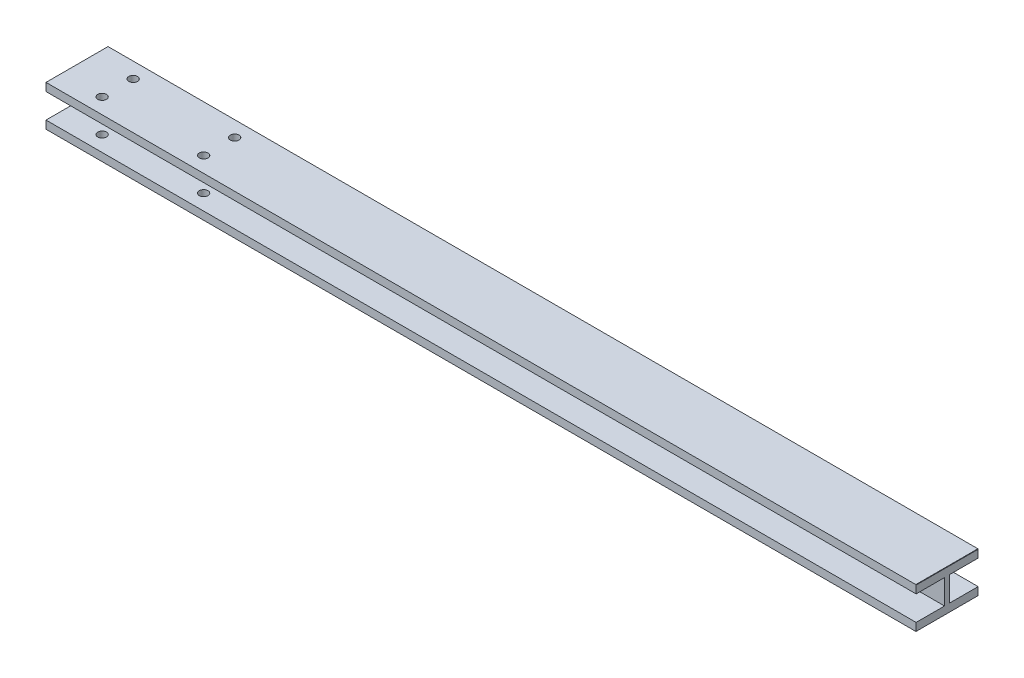
ISO-10303-21;
HEADER;
FILE_DESCRIPTION(('STEP AP214'),'2;1');
FILE_NAME('part.step','',(''),(''),'','','');
FILE_SCHEMA(('AUTOMOTIVE_DESIGN { 1 0 10303 214 1 1 1 1 }'));
ENDSEC;
DATA;
#1=APPLICATION_CONTEXT('core data for automotive mechanical design processes');
#2=APPLICATION_PROTOCOL_DEFINITION('international standard','automotive_design',2000,#1);
#3=PRODUCT_CONTEXT('',#1,'mechanical');
#4=PRODUCT('Part','Part','',(#3));
#5=PRODUCT_RELATED_PRODUCT_CATEGORY('part','',(#4));
#6=PRODUCT_DEFINITION_FORMATION('','',#4);
#7=PRODUCT_DEFINITION_CONTEXT('part definition',#1,'design');
#8=PRODUCT_DEFINITION('design','',#6,#7);
#9=PRODUCT_DEFINITION_SHAPE('','',#8);
#10=(LENGTH_UNIT() NAMED_UNIT(*) SI_UNIT(.MILLI.,.METRE.));
#11=(NAMED_UNIT(*) PLANE_ANGLE_UNIT() SI_UNIT($,.RADIAN.));
#12=(NAMED_UNIT(*) SI_UNIT($,.STERADIAN.) SOLID_ANGLE_UNIT());
#13=UNCERTAINTY_MEASURE_WITH_UNIT(LENGTH_MEASURE(1.E-05),#10,'distance_accuracy_value','');
#14=(GEOMETRIC_REPRESENTATION_CONTEXT(3) GLOBAL_UNCERTAINTY_ASSIGNED_CONTEXT((#13)) GLOBAL_UNIT_ASSIGNED_CONTEXT((#10,
#11,#12)) REPRESENTATION_CONTEXT('',''));
#15=CARTESIAN_POINT('',(0.,0.,0.));
#16=DIRECTION('',(0.,0.,1.));
#17=DIRECTION('',(1.,0.,0.));
#18=AXIS2_PLACEMENT_3D('',#15,#16,#17);
#19=CARTESIAN_POINT('',(3000.,140.,0.));
#20=DIRECTION('',(-1.,0.,0.));
#21=DIRECTION('',(0.,0.,1.));
#22=AXIS2_PLACEMENT_3D('',#19,#20,#21);
#23=PLANE('',#22);
#24=DIRECTION('',(0.,-1.,0.));
#25=VECTOR('',#24,1.);
#26=CARTESIAN_POINT('',(3000.,140.,213.9));
#27=LINE('',#26,#25);
#28=CARTESIAN_POINT('',(3000.,27.5,213.9));
#29=VERTEX_POINT('',#28);
#30=CARTESIAN_POINT('',(3000.,0.5,213.9));
#31=VERTEX_POINT('',#30);
#32=EDGE_CURVE('E230',#29,#31,#27,.T.);
#33=ORIENTED_EDGE('',*,*,#32,.T.);
#34=DIRECTION('',(0.,0.,1.));
#35=VECTOR('',#34,1.);
#36=CARTESIAN_POINT('',(3000.,0.5,213.9));
#37=LINE('',#36,#35);
#38=CARTESIAN_POINT('',(3000.,0.5,0.5));
#39=VERTEX_POINT('',#38);
#40=EDGE_CURVE('E212',#39,#31,#37,.T.);
#41=ORIENTED_EDGE('',*,*,#40,.F.);
#42=DIRECTION('',(0.,-1.,0.));
#43=VECTOR('',#42,1.);
#44=CARTESIAN_POINT('',(3000.,139.,0.5));
#45=LINE('',#44,#43);
#46=CARTESIAN_POINT('',(3000.,27.5,0.5));
#47=VERTEX_POINT('',#46);
#48=EDGE_CURVE('E543',#47,#39,#45,.T.);
#49=ORIENTED_EDGE('',*,*,#48,.F.);
#50=DIRECTION('',(0.,0.,-1.));
#51=VECTOR('',#50,1.);
#52=CARTESIAN_POINT('',(3000.,27.5,0.));
#53=LINE('',#52,#51);
#54=CARTESIAN_POINT('',(3000.,27.5,97.9999999999999));
#55=VERTEX_POINT('',#54);
#56=EDGE_CURVE('E515',#55,#47,#53,.T.);
#57=ORIENTED_EDGE('',*,*,#56,.F.);
#58=DIRECTION('',(0.,-1.,0.));
#59=VECTOR('',#58,1.);
#60=CARTESIAN_POINT('',(3000.,0.,97.9999999999999));
#61=LINE('',#60,#59);
#62=CARTESIAN_POINT('',(3000.,112.5,97.9999999999999));
#63=VERTEX_POINT('',#62);
#64=EDGE_CURVE('E511',#63,#55,#61,.T.);
#65=ORIENTED_EDGE('',*,*,#64,.F.);
#66=DIRECTION('',(0.,0.,1.));
#67=VECTOR('',#66,1.);
#68=CARTESIAN_POINT('',(3000.,112.5,0.));
#69=LINE('',#68,#67);
#70=CARTESIAN_POINT('',(3000.,112.5,0.5));
#71=VERTEX_POINT('',#70);
#72=EDGE_CURVE('E503',#71,#63,#69,.T.);
#73=ORIENTED_EDGE('',*,*,#72,.F.);
#74=CARTESIAN_POINT('',(3000.,139.,0.5));
#75=VERTEX_POINT('',#74);
#76=EDGE_CURVE('E545',#75,#71,#45,.T.);
#77=ORIENTED_EDGE('',*,*,#76,.F.);
#78=DIRECTION('',(0.,0.,-1.));
#79=VECTOR('',#78,1.);
#80=CARTESIAN_POINT('',(3000.,139.,0.));
#81=LINE('',#80,#79);
#82=CARTESIAN_POINT('',(3000.,139.,213.9));
#83=VERTEX_POINT('',#82);
#84=EDGE_CURVE('E582',#83,#75,#81,.T.);
#85=ORIENTED_EDGE('',*,*,#84,.F.);
#86=CARTESIAN_POINT('',(3000.,112.5,213.9));
#87=VERTEX_POINT('',#86);
#88=EDGE_CURVE('E239',#83,#87,#27,.T.);
#89=ORIENTED_EDGE('',*,*,#88,.T.);
#90=DIRECTION('',(0.,0.,-1.));
#91=VECTOR('',#90,1.);
#92=CARTESIAN_POINT('',(3000.,112.5,0.));
#93=LINE('',#92,#91);
#94=CARTESIAN_POINT('',(3000.,112.5,115.9));
#95=VERTEX_POINT('',#94);
#96=EDGE_CURVE('E471',#87,#95,#93,.T.);
#97=ORIENTED_EDGE('',*,*,#96,.T.);
#98=DIRECTION('',(0.,-1.,0.));
#99=VECTOR('',#98,1.);
#100=CARTESIAN_POINT('',(3000.,0.,115.9));
#101=LINE('',#100,#99);
#102=CARTESIAN_POINT('',(3000.,27.5,115.9));
#103=VERTEX_POINT('',#102);
#104=EDGE_CURVE('E480',#95,#103,#101,.T.);
#105=ORIENTED_EDGE('',*,*,#104,.T.);
#106=DIRECTION('',(0.,0.,1.));
#107=VECTOR('',#106,1.);
#108=CARTESIAN_POINT('',(3000.,27.5,0.));
#109=LINE('',#108,#107);
#110=EDGE_CURVE('E237',#103,#29,#109,.T.);
#111=ORIENTED_EDGE('',*,*,#110,.T.);
#112=EDGE_LOOP('',(#33,#41,#49,#57,#65,#73,#77,#85,#89,#97,#105,#111));
#113=FACE_BOUND('',#112,.T.);
#114=ADVANCED_FACE('F51',(#113),#23,.F.);
#115=CARTESIAN_POINT('',(0.,140.,0.));
#116=DIRECTION('',(1.,0.,0.));
#117=DIRECTION('',(0.,0.,-1.));
#118=AXIS2_PLACEMENT_3D('',#115,#116,#117);
#119=PLANE('',#118);
#120=DIRECTION('',(0.,0.,1.));
#121=VECTOR('',#120,1.);
#122=CARTESIAN_POINT('',(0.,27.5,0.));
#123=LINE('',#122,#121);
#124=CARTESIAN_POINT('',(0.,27.5,115.9));
#125=VERTEX_POINT('',#124);
#126=CARTESIAN_POINT('',(0.,27.5,213.9));
#127=VERTEX_POINT('',#126);
#128=EDGE_CURVE('E479',#125,#127,#123,.T.);
#129=ORIENTED_EDGE('',*,*,#128,.F.);
#130=DIRECTION('',(0.,-1.,0.));
#131=VECTOR('',#130,1.);
#132=CARTESIAN_POINT('',(0.,0.,115.9));
#133=LINE('',#132,#131);
#134=CARTESIAN_POINT('',(0.,112.5,115.9));
#135=VERTEX_POINT('',#134);
#136=EDGE_CURVE('E606',#135,#125,#133,.T.);
#137=ORIENTED_EDGE('',*,*,#136,.F.);
#138=DIRECTION('',(0.,0.,-1.));
#139=VECTOR('',#138,1.);
#140=CARTESIAN_POINT('',(0.,112.5,0.));
#141=LINE('',#140,#139);
#142=CARTESIAN_POINT('',(0.,112.5,213.9));
#143=VERTEX_POINT('',#142);
#144=EDGE_CURVE('E499',#143,#135,#141,.T.);
#145=ORIENTED_EDGE('',*,*,#144,.F.);
#146=DIRECTION('',(0.,-1.,0.));
#147=VECTOR('',#146,1.);
#148=CARTESIAN_POINT('',(0.,140.,213.9));
#149=LINE('',#148,#147);
#150=CARTESIAN_POINT('',(0.,140.,213.9));
#151=VERTEX_POINT('',#150);
#152=EDGE_CURVE('E251',#151,#143,#149,.T.);
#153=ORIENTED_EDGE('',*,*,#152,.F.);
#154=DIRECTION('',(0.,0.,1.));
#155=VECTOR('',#154,1.);
#156=CARTESIAN_POINT('',(0.,140.,0.));
#157=LINE('',#156,#155);
#158=CARTESIAN_POINT('',(0.,140.,0.));
#159=VERTEX_POINT('',#158);
#160=EDGE_CURVE('E356',#159,#151,#157,.T.);
#161=ORIENTED_EDGE('',*,*,#160,.F.);
#162=DIRECTION('',(0.,-1.,0.));
#163=VECTOR('',#162,1.);
#164=CARTESIAN_POINT('',(0.,140.,0.));
#165=LINE('',#164,#163);
#166=CARTESIAN_POINT('',(0.,112.5,0.));
#167=VERTEX_POINT('',#166);
#168=EDGE_CURVE('E240',#159,#167,#165,.T.);
#169=ORIENTED_EDGE('',*,*,#168,.T.);
#170=DIRECTION('',(0.,0.,1.));
#171=VECTOR('',#170,1.);
#172=CARTESIAN_POINT('',(0.,112.5,0.));
#173=LINE('',#172,#171);
#174=CARTESIAN_POINT('',(0.,112.5,97.9999999999999));
#175=VERTEX_POINT('',#174);
#176=EDGE_CURVE('E506',#167,#175,#173,.T.);
#177=ORIENTED_EDGE('',*,*,#176,.T.);
#178=DIRECTION('',(0.,-1.,0.));
#179=VECTOR('',#178,1.);
#180=CARTESIAN_POINT('',(0.,0.,97.9999999999999));
#181=LINE('',#180,#179);
#182=CARTESIAN_POINT('',(0.,27.5,97.9999999999999));
#183=VERTEX_POINT('',#182);
#184=EDGE_CURVE('E500',#175,#183,#181,.T.);
#185=ORIENTED_EDGE('',*,*,#184,.T.);
#186=DIRECTION('',(0.,0.,-1.));
#187=VECTOR('',#186,1.);
#188=CARTESIAN_POINT('',(0.,27.5,0.));
#189=LINE('',#188,#187);
#190=CARTESIAN_POINT('',(0.,27.5,0.));
#191=VERTEX_POINT('',#190);
#192=EDGE_CURVE('E393',#183,#191,#189,.T.);
#193=ORIENTED_EDGE('',*,*,#192,.T.);
#194=CARTESIAN_POINT('',(0.,0.,0.));
#195=VERTEX_POINT('',#194);
#196=EDGE_CURVE('E247',#191,#195,#165,.T.);
#197=ORIENTED_EDGE('',*,*,#196,.T.);
#198=DIRECTION('',(0.,0.,1.));
#199=VECTOR('',#198,1.);
#200=CARTESIAN_POINT('',(0.,0.,0.));
#201=LINE('',#200,#199);
#202=CARTESIAN_POINT('',(0.,0.,213.9));
#203=VERTEX_POINT('',#202);
#204=EDGE_CURVE('E351',#195,#203,#201,.T.);
#205=ORIENTED_EDGE('',*,*,#204,.T.);
#206=EDGE_CURVE('E245',#127,#203,#149,.T.);
#207=ORIENTED_EDGE('',*,*,#206,.F.);
#208=EDGE_LOOP('',(#129,#137,#145,#153,#161,#169,#177,#185,#193,#197,#205,#207));
#209=FACE_BOUND('',#208,.T.);
#210=ADVANCED_FACE('F53',(#209),#119,.F.);
#211=CARTESIAN_POINT('',(0.,140.,213.9));
#212=DIRECTION('',(0.,0.,-1.));
#213=DIRECTION('',(-1.,0.,0.));
#214=AXIS2_PLACEMENT_3D('',#211,#212,#213);
#215=PLANE('',#214);
#216=DIRECTION('',(1.,0.,0.));
#217=VECTOR('',#216,1.);
#218=CARTESIAN_POINT('',(0.,0.,213.9));
#219=LINE('',#218,#217);
#220=CARTESIAN_POINT('',(2999.,0.,213.9));
#221=VERTEX_POINT('',#220);
#222=EDGE_CURVE('E371',#203,#221,#219,.T.);
#223=ORIENTED_EDGE('',*,*,#222,.T.);
#224=DIRECTION('',(0.,-1.,0.));
#225=VECTOR('',#224,1.);
#226=CARTESIAN_POINT('',(2999.,0.5,213.9));
#227=LINE('',#226,#225);
#228=CARTESIAN_POINT('',(2999.,0.5,213.9));
#229=VERTEX_POINT('',#228);
#230=EDGE_CURVE('E231',#229,#221,#227,.T.);
#231=ORIENTED_EDGE('',*,*,#230,.F.);
#232=DIRECTION('',(-1.,0.,0.));
#233=VECTOR('',#232,1.);
#234=CARTESIAN_POINT('',(3000.,0.5,213.9));
#235=LINE('',#234,#233);
#236=EDGE_CURVE('E216',#31,#229,#235,.T.);
#237=ORIENTED_EDGE('',*,*,#236,.F.);
#238=ORIENTED_EDGE('',*,*,#32,.F.);
#239=DIRECTION('',(1.,0.,0.));
#240=VECTOR('',#239,1.);
#241=CARTESIAN_POINT('',(0.,27.5,213.9));
#242=LINE('',#241,#240);
#243=EDGE_CURVE('E260',#127,#29,#242,.T.);
#244=ORIENTED_EDGE('',*,*,#243,.F.);
#245=ORIENTED_EDGE('',*,*,#206,.T.);
#246=EDGE_LOOP('',(#223,#231,#237,#238,#244,#245));
#247=FACE_BOUND('',#246,.T.);
#248=ADVANCED_FACE('F228',(#247),#215,.F.);
#249=DIRECTION('',(1.,0.,0.));
#250=VECTOR('',#249,1.);
#251=CARTESIAN_POINT('',(3000.,139.,213.9));
#252=LINE('',#251,#250);
#253=CARTESIAN_POINT('',(2999.,139.,213.9));
#254=VERTEX_POINT('',#253);
#255=EDGE_CURVE('E593',#254,#83,#252,.T.);
#256=ORIENTED_EDGE('',*,*,#255,.F.);
#257=DIRECTION('',(0.,1.,0.));
#258=VECTOR('',#257,1.);
#259=CARTESIAN_POINT('',(2999.,139.,213.9));
#260=LINE('',#259,#258);
#261=CARTESIAN_POINT('',(2999.,140.,213.9));
#262=VERTEX_POINT('',#261);
#263=EDGE_CURVE('E516',#254,#262,#260,.T.);
#264=ORIENTED_EDGE('',*,*,#263,.T.);
#265=DIRECTION('',(1.,0.,0.));
#266=VECTOR('',#265,1.);
#267=CARTESIAN_POINT('',(0.,140.,213.9));
#268=LINE('',#267,#266);
#269=EDGE_CURVE('E360',#151,#262,#268,.T.);
#270=ORIENTED_EDGE('',*,*,#269,.F.);
#271=ORIENTED_EDGE('',*,*,#152,.T.);
#272=DIRECTION('',(1.,0.,0.));
#273=VECTOR('',#272,1.);
#274=CARTESIAN_POINT('',(0.,112.5,213.9));
#275=LINE('',#274,#273);
#276=EDGE_CURVE('E473',#143,#87,#275,.T.);
#277=ORIENTED_EDGE('',*,*,#276,.T.);
#278=ORIENTED_EDGE('',*,*,#88,.F.);
#279=EDGE_LOOP('',(#256,#264,#270,#271,#277,#278));
#280=FACE_BOUND('',#279,.T.);
#281=ADVANCED_FACE('F485',(#280),#215,.F.);
#282=CARTESIAN_POINT('',(0.,140.,0.));
#283=DIRECTION('',(0.,0.,1.));
#284=DIRECTION('',(1.,0.,0.));
#285=AXIS2_PLACEMENT_3D('',#282,#283,#284);
#286=PLANE('',#285);
#287=DIRECTION('',(-1.,0.,0.));
#288=VECTOR('',#287,1.);
#289=CARTESIAN_POINT('',(3000.,139.,0.));
#290=LINE('',#289,#288);
#291=CARTESIAN_POINT('',(2999.5,139.,0.));
#292=VERTEX_POINT('',#291);
#293=CARTESIAN_POINT('',(2999.,139.,0.));
#294=VERTEX_POINT('',#293);
#295=EDGE_CURVE('E586',#292,#294,#290,.T.);
#296=ORIENTED_EDGE('',*,*,#295,.F.);
#297=DIRECTION('',(0.,1.,0.));
#298=VECTOR('',#297,1.);
#299=CARTESIAN_POINT('',(2999.5,139.,0.));
#300=LINE('',#299,#298);
#301=CARTESIAN_POINT('',(2999.5,112.5,0.));
#302=VERTEX_POINT('',#301);
#303=EDGE_CURVE('E552',#302,#292,#300,.T.);
#304=ORIENTED_EDGE('',*,*,#303,.F.);
#305=DIRECTION('',(1.,0.,0.));
#306=VECTOR('',#305,1.);
#307=CARTESIAN_POINT('',(0.,112.5,0.));
#308=LINE('',#307,#306);
#309=EDGE_CURVE('E526',#167,#302,#308,.T.);
#310=ORIENTED_EDGE('',*,*,#309,.F.);
#311=ORIENTED_EDGE('',*,*,#168,.F.);
#312=DIRECTION('',(-1.,0.,0.));
#313=VECTOR('',#312,1.);
#314=CARTESIAN_POINT('',(0.,140.,0.));
#315=LINE('',#314,#313);
#316=CARTESIAN_POINT('',(2999.,140.,0.));
#317=VERTEX_POINT('',#316);
#318=EDGE_CURVE('E365',#317,#159,#315,.T.);
#319=ORIENTED_EDGE('',*,*,#318,.F.);
#320=DIRECTION('',(0.,1.,0.));
#321=VECTOR('',#320,1.);
#322=CARTESIAN_POINT('',(2999.,139.,0.));
#323=LINE('',#322,#321);
#324=EDGE_CURVE('E596',#294,#317,#323,.T.);
#325=ORIENTED_EDGE('',*,*,#324,.F.);
#326=EDGE_LOOP('',(#296,#304,#310,#311,#319,#325));
#327=FACE_BOUND('',#326,.T.);
#328=ADVANCED_FACE('F627',(#327),#286,.F.);
#329=CARTESIAN_POINT('',(140.,140.,53.4749999999998));
#330=DIRECTION('',(0.,-1.,0.));
#331=DIRECTION('',(0.,0.,-1.));
#332=AXIS2_PLACEMENT_3D('',#329,#330,#331);
#333=CYLINDRICAL_SURFACE('',#332,15.);
#334=CARTESIAN_POINT('',(140.,112.5,53.4749999999998));
#335=DIRECTION('',(0.,1.,0.));
#336=DIRECTION('',(0.,0.,1.));
#337=AXIS2_PLACEMENT_3D('',#334,#335,#336);
#338=CIRCLE('',#337,15.);
#339=CARTESIAN_POINT('',(140.,112.5,68.4749999999998));
#340=VERTEX_POINT('',#339);
#341=EDGE_CURVE('E287',#340,#340,#338,.T.);
#342=ORIENTED_EDGE('',*,*,#341,.F.);
#343=EDGE_LOOP('',(#342));
#344=FACE_BOUND('',#343,.T.);
#345=CARTESIAN_POINT('',(140.,140.,53.4749999999998));
#346=DIRECTION('',(0.,1.,0.));
#347=DIRECTION('',(0.,0.,1.));
#348=AXIS2_PLACEMENT_3D('',#345,#346,#347);
#349=CIRCLE('',#348,15.);
#350=CARTESIAN_POINT('',(140.,140.,68.4749999999998));
#351=VERTEX_POINT('',#350);
#352=EDGE_CURVE('E348',#351,#351,#349,.T.);
#353=ORIENTED_EDGE('',*,*,#352,.T.);
#354=EDGE_LOOP('',(#353));
#355=FACE_BOUND('',#354,.T.);
#356=ADVANCED_FACE('F696',(#344,#355),#333,.F.);
#357=CARTESIAN_POINT('',(140.,140.,160.425));
#358=DIRECTION('',(0.,-1.,0.));
#359=DIRECTION('',(0.,0.,-1.));
#360=AXIS2_PLACEMENT_3D('',#357,#358,#359);
#361=CYLINDRICAL_SURFACE('',#360,15.);
#362=CARTESIAN_POINT('',(140.,0.,160.425));
#363=DIRECTION('',(0.,1.,0.));
#364=DIRECTION('',(0.,0.,-1.));
#365=AXIS2_PLACEMENT_3D('',#362,#363,#364);
#366=CIRCLE('',#365,15.);
#367=CARTESIAN_POINT('',(140.,0.,145.425));
#368=VERTEX_POINT('',#367);
#369=EDGE_CURVE('E343',#368,#368,#366,.T.);
#370=ORIENTED_EDGE('',*,*,#369,.F.);
#371=EDGE_LOOP('',(#370));
#372=FACE_BOUND('',#371,.T.);
#373=CARTESIAN_POINT('',(140.,27.5,160.425));
#374=DIRECTION('',(0.,1.,0.));
#375=DIRECTION('',(0.,0.,1.));
#376=AXIS2_PLACEMENT_3D('',#373,#374,#375);
#377=CIRCLE('',#376,15.);
#378=CARTESIAN_POINT('',(140.,27.5,175.425));
#379=VERTEX_POINT('',#378);
#380=EDGE_CURVE('E266',#379,#379,#377,.T.);
#381=ORIENTED_EDGE('',*,*,#380,.T.);
#382=EDGE_LOOP('',(#381));
#383=FACE_BOUND('',#382,.T.);
#384=ADVANCED_FACE('F702',(#372,#383),#361,.F.);
#385=CARTESIAN_POINT('',(140.,140.,160.425));
#386=DIRECTION('',(0.,1.,0.));
#387=DIRECTION('',(0.,0.,-1.));
#388=AXIS2_PLACEMENT_3D('',#385,#386,#387);
#389=CIRCLE('',#388,15.);
#390=CARTESIAN_POINT('',(140.,140.,145.425));
#391=VERTEX_POINT('',#390);
#392=EDGE_CURVE('E339',#391,#391,#389,.T.);
#393=ORIENTED_EDGE('',*,*,#392,.T.);
#394=EDGE_LOOP('',(#393));
#395=FACE_BOUND('',#394,.T.);
#396=CARTESIAN_POINT('',(140.,112.5,160.425));
#397=DIRECTION('',(0.,-1.,0.));
#398=DIRECTION('',(0.,0.,-1.));
#399=AXIS2_PLACEMENT_3D('',#396,#397,#398);
#400=CIRCLE('',#399,15.);
#401=CARTESIAN_POINT('',(140.,112.5,145.425));
#402=VERTEX_POINT('',#401);
#403=EDGE_CURVE('E259',#402,#402,#400,.T.);
#404=ORIENTED_EDGE('',*,*,#403,.T.);
#405=EDGE_LOOP('',(#404));
#406=FACE_BOUND('',#405,.T.);
#407=ADVANCED_FACE('F419',(#395,#406),#361,.F.);
#408=CARTESIAN_POINT('',(490.,140.,53.4749999999997));
#409=DIRECTION('',(0.,-1.,0.));
#410=DIRECTION('',(0.,0.,-1.));
#411=AXIS2_PLACEMENT_3D('',#408,#409,#410);
#412=CYLINDRICAL_SURFACE('',#411,15.);
#413=CARTESIAN_POINT('',(490.,112.5,53.4749999999997));
#414=DIRECTION('',(0.,1.,0.));
#415=DIRECTION('',(0.,0.,1.));
#416=AXIS2_PLACEMENT_3D('',#413,#414,#415);
#417=CIRCLE('',#416,15.);
#418=CARTESIAN_POINT('',(490.,112.5,68.4749999999997));
#419=VERTEX_POINT('',#418);
#420=EDGE_CURVE('E286',#419,#419,#417,.T.);
#421=ORIENTED_EDGE('',*,*,#420,.F.);
#422=EDGE_LOOP('',(#421));
#423=FACE_BOUND('',#422,.T.);
#424=CARTESIAN_POINT('',(490.,140.,53.4749999999997));
#425=DIRECTION('',(0.,1.,0.));
#426=DIRECTION('',(0.,0.,1.));
#427=AXIS2_PLACEMENT_3D('',#424,#425,#426);
#428=CIRCLE('',#427,15.);
#429=CARTESIAN_POINT('',(490.,140.,68.4749999999997));
#430=VERTEX_POINT('',#429);
#431=EDGE_CURVE('E330',#430,#430,#428,.T.);
#432=ORIENTED_EDGE('',*,*,#431,.T.);
#433=EDGE_LOOP('',(#432));
#434=FACE_BOUND('',#433,.T.);
#435=ADVANCED_FACE('F415',(#423,#434),#412,.F.);
#436=CARTESIAN_POINT('',(490.,140.,160.425));
#437=DIRECTION('',(0.,-1.,0.));
#438=DIRECTION('',(0.,0.,-1.));
#439=AXIS2_PLACEMENT_3D('',#436,#437,#438);
#440=CYLINDRICAL_SURFACE('',#439,15.);
#441=CARTESIAN_POINT('',(490.,0.,160.425));
#442=DIRECTION('',(0.,1.,0.));
#443=DIRECTION('',(0.,0.,-1.));
#444=AXIS2_PLACEMENT_3D('',#441,#442,#443);
#445=CIRCLE('',#444,15.);
#446=CARTESIAN_POINT('',(490.,0.,145.425));
#447=VERTEX_POINT('',#446);
#448=EDGE_CURVE('E317',#447,#447,#445,.T.);
#449=ORIENTED_EDGE('',*,*,#448,.F.);
#450=EDGE_LOOP('',(#449));
#451=FACE_BOUND('',#450,.T.);
#452=CARTESIAN_POINT('',(490.,27.5,160.425));
#453=DIRECTION('',(0.,1.,0.));
#454=DIRECTION('',(0.,0.,1.));
#455=AXIS2_PLACEMENT_3D('',#452,#453,#454);
#456=CIRCLE('',#455,15.);
#457=CARTESIAN_POINT('',(490.,27.5,175.425));
#458=VERTEX_POINT('',#457);
#459=EDGE_CURVE('E261',#458,#458,#456,.T.);
#460=ORIENTED_EDGE('',*,*,#459,.T.);
#461=EDGE_LOOP('',(#460));
#462=FACE_BOUND('',#461,.T.);
#463=ADVANCED_FACE('F418',(#451,#462),#440,.F.);
#464=CARTESIAN_POINT('',(490.,140.,160.425));
#465=DIRECTION('',(0.,1.,0.));
#466=DIRECTION('',(0.,0.,-1.));
#467=AXIS2_PLACEMENT_3D('',#464,#465,#466);
#468=CIRCLE('',#467,15.);
#469=CARTESIAN_POINT('',(490.,140.,145.425));
#470=VERTEX_POINT('',#469);
#471=EDGE_CURVE('E321',#470,#470,#468,.T.);
#472=ORIENTED_EDGE('',*,*,#471,.T.);
#473=EDGE_LOOP('',(#472));
#474=FACE_BOUND('',#473,.T.);
#475=CARTESIAN_POINT('',(490.,112.5,160.425));
#476=DIRECTION('',(0.,-1.,0.));
#477=DIRECTION('',(0.,0.,-1.));
#478=AXIS2_PLACEMENT_3D('',#475,#476,#477);
#479=CIRCLE('',#478,15.);
#480=CARTESIAN_POINT('',(490.,112.5,145.425));
#481=VERTEX_POINT('',#480);
#482=EDGE_CURVE('E255',#481,#481,#479,.T.);
#483=ORIENTED_EDGE('',*,*,#482,.T.);
#484=EDGE_LOOP('',(#483));
#485=FACE_BOUND('',#484,.T.);
#486=ADVANCED_FACE('F448',(#474,#485),#440,.F.);
#487=CARTESIAN_POINT('',(0.,140.,0.));
#488=DIRECTION('',(0.,1.,0.));
#489=DIRECTION('',(0.,0.,1.));
#490=AXIS2_PLACEMENT_3D('',#487,#488,#489);
#491=PLANE('',#490);
#492=DIRECTION('',(0.,0.,1.));
#493=VECTOR('',#492,1.);
#494=CARTESIAN_POINT('',(2999.,140.,0.));
#495=LINE('',#494,#493);
#496=EDGE_CURVE('E581',#317,#262,#495,.T.);
#497=ORIENTED_EDGE('',*,*,#496,.F.);
#498=ORIENTED_EDGE('',*,*,#318,.T.);
#499=ORIENTED_EDGE('',*,*,#160,.T.);
#500=ORIENTED_EDGE('',*,*,#269,.T.);
#501=EDGE_LOOP('',(#497,#498,#499,#500));
#502=FACE_BOUND('',#501,.T.);
#503=ORIENTED_EDGE('',*,*,#431,.F.);
#504=EDGE_LOOP('',(#503));
#505=FACE_BOUND('',#504,.T.);
#506=ORIENTED_EDGE('',*,*,#352,.F.);
#507=EDGE_LOOP('',(#506));
#508=FACE_BOUND('',#507,.T.);
#509=ORIENTED_EDGE('',*,*,#392,.F.);
#510=EDGE_LOOP('',(#509));
#511=FACE_BOUND('',#510,.T.);
#512=ORIENTED_EDGE('',*,*,#471,.F.);
#513=EDGE_LOOP('',(#512));
#514=FACE_BOUND('',#513,.T.);
#515=ADVANCED_FACE('F445',(#502,#505,#508,#511,#514),#491,.T.);
#516=CARTESIAN_POINT('',(0.,0.,0.));
#517=DIRECTION('',(0.,1.,0.));
#518=DIRECTION('',(0.,0.,1.));
#519=AXIS2_PLACEMENT_3D('',#516,#517,#518);
#520=PLANE('',#519);
#521=DIRECTION('',(-1.,0.,0.));
#522=VECTOR('',#521,1.);
#523=CARTESIAN_POINT('',(0.,0.,0.));
#524=LINE('',#523,#522);
#525=CARTESIAN_POINT('',(2999.,0.,0.));
#526=VERTEX_POINT('',#525);
#527=EDGE_CURVE('E361',#526,#195,#524,.T.);
#528=ORIENTED_EDGE('',*,*,#527,.F.);
#529=DIRECTION('',(0.,0.,-1.));
#530=VECTOR('',#529,1.);
#531=CARTESIAN_POINT('',(2999.,0.,213.9));
#532=LINE('',#531,#530);
#533=CARTESIAN_POINT('',(2999.,0.,103.95));
#534=VERTEX_POINT('',#533);
#535=EDGE_CURVE('E938',#534,#526,#532,.T.);
#536=ORIENTED_EDGE('',*,*,#535,.F.);
#537=DIRECTION('',(1.,0.,0.));
#538=VECTOR('',#537,1.);
#539=CARTESIAN_POINT('',(3000.,0.,103.95));
#540=LINE('',#539,#538);
#541=CARTESIAN_POINT('',(2997.,0.,103.95));
#542=VERTEX_POINT('',#541);
#543=EDGE_CURVE('E296',#542,#534,#540,.T.);
#544=ORIENTED_EDGE('',*,*,#543,.F.);
#545=DIRECTION('',(0.,0.,-1.));
#546=VECTOR('',#545,1.);
#547=CARTESIAN_POINT('',(2997.,0.,109.95));
#548=LINE('',#547,#546);
#549=CARTESIAN_POINT('',(2997.,0.,109.95));
#550=VERTEX_POINT('',#549);
#551=EDGE_CURVE('E307',#550,#542,#548,.T.);
#552=ORIENTED_EDGE('',*,*,#551,.F.);
#553=DIRECTION('',(-1.,0.,0.));
#554=VECTOR('',#553,1.);
#555=CARTESIAN_POINT('',(3000.,0.,109.95));
#556=LINE('',#555,#554);
#557=CARTESIAN_POINT('',(2999.,0.,109.95));
#558=VERTEX_POINT('',#557);
#559=EDGE_CURVE('E291',#558,#550,#556,.T.);
#560=ORIENTED_EDGE('',*,*,#559,.F.);
#561=EDGE_CURVE('E223',#221,#558,#532,.T.);
#562=ORIENTED_EDGE('',*,*,#561,.F.);
#563=ORIENTED_EDGE('',*,*,#222,.F.);
#564=ORIENTED_EDGE('',*,*,#204,.F.);
#565=EDGE_LOOP('',(#528,#536,#544,#552,#560,#562,#563,#564));
#566=FACE_BOUND('',#565,.T.);
#567=CARTESIAN_POINT('',(140.,0.,53.4749999999998));
#568=DIRECTION('',(0.,1.,0.));
#569=DIRECTION('',(0.,0.,1.));
#570=AXIS2_PLACEMENT_3D('',#567,#568,#569);
#571=CIRCLE('',#570,15.);
#572=CARTESIAN_POINT('',(140.,0.,68.4749999999998));
#573=VERTEX_POINT('',#572);
#574=EDGE_CURVE('E342',#573,#573,#571,.T.);
#575=ORIENTED_EDGE('',*,*,#574,.T.);
#576=EDGE_LOOP('',(#575));
#577=FACE_BOUND('',#576,.T.);
#578=ORIENTED_EDGE('',*,*,#369,.T.);
#579=EDGE_LOOP('',(#578));
#580=FACE_BOUND('',#579,.T.);
#581=CARTESIAN_POINT('',(490.,0.,53.4749999999997));
#582=DIRECTION('',(0.,1.,0.));
#583=DIRECTION('',(0.,0.,1.));
#584=AXIS2_PLACEMENT_3D('',#581,#582,#583);
#585=CIRCLE('',#584,15.);
#586=CARTESIAN_POINT('',(490.,0.,68.4749999999997));
#587=VERTEX_POINT('',#586);
#588=EDGE_CURVE('E325',#587,#587,#585,.T.);
#589=ORIENTED_EDGE('',*,*,#588,.T.);
#590=EDGE_LOOP('',(#589));
#591=FACE_BOUND('',#590,.T.);
#592=ORIENTED_EDGE('',*,*,#448,.T.);
#593=EDGE_LOOP('',(#592));
#594=FACE_BOUND('',#593,.T.);
#595=ADVANCED_FACE('F396',(#566,#577,#580,#591,#594),#520,.F.);
#596=DIRECTION('',(1.,0.,0.));
#597=VECTOR('',#596,1.);
#598=CARTESIAN_POINT('',(3000.,0.5,0.));
#599=LINE('',#598,#597);
#600=CARTESIAN_POINT('',(2999.,0.5,0.));
#601=VERTEX_POINT('',#600);
#602=CARTESIAN_POINT('',(2999.5,0.5,0.));
#603=VERTEX_POINT('',#602);
#604=EDGE_CURVE('E947',#601,#603,#599,.T.);
#605=ORIENTED_EDGE('',*,*,#604,.F.);
#606=DIRECTION('',(0.,-1.,0.));
#607=VECTOR('',#606,1.);
#608=CARTESIAN_POINT('',(2999.,0.5,0.));
#609=LINE('',#608,#607);
#610=EDGE_CURVE('E383',#601,#526,#609,.T.);
#611=ORIENTED_EDGE('',*,*,#610,.T.);
#612=ORIENTED_EDGE('',*,*,#527,.T.);
#613=ORIENTED_EDGE('',*,*,#196,.F.);
#614=DIRECTION('',(1.,0.,0.));
#615=VECTOR('',#614,1.);
#616=CARTESIAN_POINT('',(0.,27.5,0.));
#617=LINE('',#616,#615);
#618=CARTESIAN_POINT('',(2999.5,27.5,0.));
#619=VERTEX_POINT('',#618);
#620=EDGE_CURVE('E530',#191,#619,#617,.T.);
#621=ORIENTED_EDGE('',*,*,#620,.T.);
#622=EDGE_CURVE('E546',#603,#619,#300,.T.);
#623=ORIENTED_EDGE('',*,*,#622,.F.);
#624=EDGE_LOOP('',(#605,#611,#612,#613,#621,#623));
#625=FACE_BOUND('',#624,.T.);
#626=ADVANCED_FACE('F381',(#625),#286,.F.);
#627=CARTESIAN_POINT('',(140.,27.5,53.4749999999998));
#628=DIRECTION('',(0.,-1.,0.));
#629=DIRECTION('',(0.,0.,-1.));
#630=AXIS2_PLACEMENT_3D('',#627,#628,#629);
#631=CIRCLE('',#630,15.);
#632=CARTESIAN_POINT('',(140.,27.5,38.4749999999998));
#633=VERTEX_POINT('',#632);
#634=EDGE_CURVE('E281',#633,#633,#631,.T.);
#635=ORIENTED_EDGE('',*,*,#634,.F.);
#636=EDGE_LOOP('',(#635));
#637=FACE_BOUND('',#636,.T.);
#638=ORIENTED_EDGE('',*,*,#574,.F.);
#639=EDGE_LOOP('',(#638));
#640=FACE_BOUND('',#639,.T.);
#641=ADVANCED_FACE('F705',(#637,#640),#333,.F.);
#642=CARTESIAN_POINT('',(490.,27.5,53.4749999999997));
#643=DIRECTION('',(0.,-1.,0.));
#644=DIRECTION('',(0.,0.,-1.));
#645=AXIS2_PLACEMENT_3D('',#642,#643,#644);
#646=CIRCLE('',#645,15.);
#647=CARTESIAN_POINT('',(490.,27.5,38.4749999999997));
#648=VERTEX_POINT('',#647);
#649=EDGE_CURVE('E267',#648,#648,#646,.T.);
#650=ORIENTED_EDGE('',*,*,#649,.F.);
#651=EDGE_LOOP('',(#650));
#652=FACE_BOUND('',#651,.T.);
#653=ORIENTED_EDGE('',*,*,#588,.F.);
#654=EDGE_LOOP('',(#653));
#655=FACE_BOUND('',#654,.T.);
#656=ADVANCED_FACE('F421',(#652,#655),#412,.F.);
#657=CARTESIAN_POINT('',(3000.,0.1,103.95));
#658=DIRECTION('',(0.,0.,-1.));
#659=DIRECTION('',(-1.,0.,0.));
#660=AXIS2_PLACEMENT_3D('',#657,#658,#659);
#661=PLANE('',#660);
#662=ORIENTED_EDGE('',*,*,#543,.T.);
#663=DIRECTION('',(0.,1.,0.));
#664=VECTOR('',#663,1.);
#665=CARTESIAN_POINT('',(2999.,0.1,103.95));
#666=LINE('',#665,#664);
#667=CARTESIAN_POINT('',(2999.,0.1,103.95));
#668=VERTEX_POINT('',#667);
#669=EDGE_CURVE('E556',#534,#668,#666,.T.);
#670=ORIENTED_EDGE('',*,*,#669,.T.);
#671=DIRECTION('',(1.,0.,0.));
#672=VECTOR('',#671,1.);
#673=CARTESIAN_POINT('',(3000.,0.1,103.95));
#674=LINE('',#673,#672);
#675=CARTESIAN_POINT('',(2997.,0.1,103.95));
#676=VERTEX_POINT('',#675);
#677=EDGE_CURVE('E300',#676,#668,#674,.T.);
#678=ORIENTED_EDGE('',*,*,#677,.F.);
#679=DIRECTION('',(0.,-1.,0.));
#680=VECTOR('',#679,1.);
#681=CARTESIAN_POINT('',(2997.,0.1,103.95));
#682=LINE('',#681,#680);
#683=EDGE_CURVE('E314',#676,#542,#682,.T.);
#684=ORIENTED_EDGE('',*,*,#683,.T.);
#685=EDGE_LOOP('',(#662,#670,#678,#684));
#686=FACE_BOUND('',#685,.T.);
#687=ADVANCED_FACE('F718',(#686),#661,.F.);
#688=CARTESIAN_POINT('',(2997.,0.1,109.95));
#689=DIRECTION('',(-1.,0.,0.));
#690=DIRECTION('',(0.,0.,1.));
#691=AXIS2_PLACEMENT_3D('',#688,#689,#690);
#692=PLANE('',#691);
#693=ORIENTED_EDGE('',*,*,#551,.T.);
#694=ORIENTED_EDGE('',*,*,#683,.F.);
#695=DIRECTION('',(0.,0.,-1.));
#696=VECTOR('',#695,1.);
#697=CARTESIAN_POINT('',(2997.,0.1,109.95));
#698=LINE('',#697,#696);
#699=CARTESIAN_POINT('',(2997.,0.1,109.95));
#700=VERTEX_POINT('',#699);
#701=EDGE_CURVE('E295',#700,#676,#698,.T.);
#702=ORIENTED_EDGE('',*,*,#701,.F.);
#703=DIRECTION('',(0.,-1.,0.));
#704=VECTOR('',#703,1.);
#705=CARTESIAN_POINT('',(2997.,0.1,109.95));
#706=LINE('',#705,#704);
#707=EDGE_CURVE('E304',#700,#550,#706,.T.);
#708=ORIENTED_EDGE('',*,*,#707,.T.);
#709=EDGE_LOOP('',(#693,#694,#702,#708));
#710=FACE_BOUND('',#709,.T.);
#711=ADVANCED_FACE('F727',(#710),#692,.F.);
#712=CARTESIAN_POINT('',(3000.,0.1,109.95));
#713=DIRECTION('',(0.,0.,1.));
#714=DIRECTION('',(1.,0.,0.));
#715=AXIS2_PLACEMENT_3D('',#712,#713,#714);
#716=PLANE('',#715);
#717=DIRECTION('',(-1.,0.,0.));
#718=VECTOR('',#717,1.);
#719=CARTESIAN_POINT('',(3000.,0.1,109.95));
#720=LINE('',#719,#718);
#721=CARTESIAN_POINT('',(2999.,0.1,109.95));
#722=VERTEX_POINT('',#721);
#723=EDGE_CURVE('E292',#722,#700,#720,.T.);
#724=ORIENTED_EDGE('',*,*,#723,.F.);
#725=DIRECTION('',(0.,-1.,0.));
#726=VECTOR('',#725,1.);
#727=CARTESIAN_POINT('',(2999.,0.1,109.95));
#728=LINE('',#727,#726);
#729=EDGE_CURVE('E954',#722,#558,#728,.T.);
#730=ORIENTED_EDGE('',*,*,#729,.T.);
#731=ORIENTED_EDGE('',*,*,#559,.T.);
#732=ORIENTED_EDGE('',*,*,#707,.F.);
#733=EDGE_LOOP('',(#724,#730,#731,#732));
#734=FACE_BOUND('',#733,.T.);
#735=ADVANCED_FACE('F723',(#734),#716,.F.);
#736=CARTESIAN_POINT('',(0.,0.1,0.));
#737=DIRECTION('',(0.,1.,0.));
#738=DIRECTION('',(0.,0.,1.));
#739=AXIS2_PLACEMENT_3D('',#736,#737,#738);
#740=PLANE('',#739);
#741=ORIENTED_EDGE('',*,*,#677,.T.);
#742=DIRECTION('',(0.,0.,1.));
#743=VECTOR('',#742,1.);
#744=CARTESIAN_POINT('',(2999.,0.1,0.));
#745=LINE('',#744,#743);
#746=EDGE_CURVE('E12',#668,#722,#745,.T.);
#747=ORIENTED_EDGE('',*,*,#746,.T.);
#748=ORIENTED_EDGE('',*,*,#723,.T.);
#749=ORIENTED_EDGE('',*,*,#701,.T.);
#750=EDGE_LOOP('',(#741,#747,#748,#749));
#751=FACE_BOUND('',#750,.T.);
#752=ADVANCED_FACE('F726',(#751),#740,.F.);
#753=CARTESIAN_POINT('',(0.,27.5,0.));
#754=DIRECTION('',(0.,1.,0.));
#755=DIRECTION('',(0.,0.,1.));
#756=AXIS2_PLACEMENT_3D('',#753,#754,#755);
#757=PLANE('',#756);
#758=ORIENTED_EDGE('',*,*,#380,.F.);
#759=EDGE_LOOP('',(#758));
#760=FACE_BOUND('',#759,.T.);
#761=ORIENTED_EDGE('',*,*,#459,.F.);
#762=EDGE_LOOP('',(#761));
#763=FACE_BOUND('',#762,.T.);
#764=ORIENTED_EDGE('',*,*,#110,.F.);
#765=DIRECTION('',(1.,0.,0.));
#766=VECTOR('',#765,1.);
#767=CARTESIAN_POINT('',(0.,27.5,115.9));
#768=LINE('',#767,#766);
#769=EDGE_CURVE('E493',#125,#103,#768,.T.);
#770=ORIENTED_EDGE('',*,*,#769,.F.);
#771=ORIENTED_EDGE('',*,*,#128,.T.);
#772=ORIENTED_EDGE('',*,*,#243,.T.);
#773=EDGE_LOOP('',(#764,#770,#771,#772));
#774=FACE_BOUND('',#773,.T.);
#775=ADVANCED_FACE('F466',(#760,#763,#774),#757,.T.);
#776=CARTESIAN_POINT('',(0.,112.5,0.));
#777=DIRECTION('',(0.,-1.,0.));
#778=DIRECTION('',(0.,0.,-1.));
#779=AXIS2_PLACEMENT_3D('',#776,#777,#778);
#780=PLANE('',#779);
#781=ORIENTED_EDGE('',*,*,#403,.F.);
#782=EDGE_LOOP('',(#781));
#783=FACE_BOUND('',#782,.T.);
#784=ORIENTED_EDGE('',*,*,#482,.F.);
#785=EDGE_LOOP('',(#784));
#786=FACE_BOUND('',#785,.T.);
#787=ORIENTED_EDGE('',*,*,#96,.F.);
#788=ORIENTED_EDGE('',*,*,#276,.F.);
#789=ORIENTED_EDGE('',*,*,#144,.T.);
#790=DIRECTION('',(1.,0.,0.));
#791=VECTOR('',#790,1.);
#792=CARTESIAN_POINT('',(0.,112.5,115.9));
#793=LINE('',#792,#791);
#794=EDGE_CURVE('E476',#135,#95,#793,.T.);
#795=ORIENTED_EDGE('',*,*,#794,.T.);
#796=EDGE_LOOP('',(#787,#788,#789,#795));
#797=FACE_BOUND('',#796,.T.);
#798=ADVANCED_FACE('F462',(#783,#786,#797),#780,.T.);
#799=CARTESIAN_POINT('',(0.,0.,115.9));
#800=DIRECTION('',(0.,0.,1.));
#801=DIRECTION('',(1.,0.,0.));
#802=AXIS2_PLACEMENT_3D('',#799,#800,#801);
#803=PLANE('',#802);
#804=ORIENTED_EDGE('',*,*,#104,.F.);
#805=ORIENTED_EDGE('',*,*,#794,.F.);
#806=ORIENTED_EDGE('',*,*,#136,.T.);
#807=ORIENTED_EDGE('',*,*,#769,.T.);
#808=EDGE_LOOP('',(#804,#805,#806,#807));
#809=FACE_BOUND('',#808,.T.);
#810=ADVANCED_FACE('F465',(#809),#803,.T.);
#811=CARTESIAN_POINT('',(0.,0.,97.9999999999999));
#812=DIRECTION('',(0.,0.,1.));
#813=DIRECTION('',(0.,-1.,0.));
#814=AXIS2_PLACEMENT_3D('',#811,#812,#813);
#815=PLANE('',#814);
#816=ORIENTED_EDGE('',*,*,#64,.T.);
#817=DIRECTION('',(1.,0.,0.));
#818=VECTOR('',#817,1.);
#819=CARTESIAN_POINT('',(0.,27.5,97.9999999999999));
#820=LINE('',#819,#818);
#821=EDGE_CURVE('E510',#183,#55,#820,.T.);
#822=ORIENTED_EDGE('',*,*,#821,.F.);
#823=ORIENTED_EDGE('',*,*,#184,.F.);
#824=DIRECTION('',(1.,0.,0.));
#825=VECTOR('',#824,1.);
#826=CARTESIAN_POINT('',(0.,112.5,97.9999999999999));
#827=LINE('',#826,#825);
#828=EDGE_CURVE('E522',#175,#63,#827,.T.);
#829=ORIENTED_EDGE('',*,*,#828,.T.);
#830=EDGE_LOOP('',(#816,#822,#823,#829));
#831=FACE_BOUND('',#830,.T.);
#832=ADVANCED_FACE('F541',(#831),#815,.F.);
#833=CARTESIAN_POINT('',(0.,112.5,0.));
#834=DIRECTION('',(0.,1.,0.));
#835=DIRECTION('',(0.,0.,1.));
#836=AXIS2_PLACEMENT_3D('',#833,#834,#835);
#837=PLANE('',#836);
#838=ORIENTED_EDGE('',*,*,#341,.T.);
#839=EDGE_LOOP('',(#838));
#840=FACE_BOUND('',#839,.T.);
#841=ORIENTED_EDGE('',*,*,#420,.T.);
#842=EDGE_LOOP('',(#841));
#843=FACE_BOUND('',#842,.T.);
#844=ORIENTED_EDGE('',*,*,#309,.T.);
#845=DIRECTION('',(0.,0.,1.));
#846=VECTOR('',#845,1.);
#847=CARTESIAN_POINT('',(2999.5,112.5,0.));
#848=LINE('',#847,#846);
#849=CARTESIAN_POINT('',(2999.5,112.5,0.5));
#850=VERTEX_POINT('',#849);
#851=EDGE_CURVE('E577',#302,#850,#848,.T.);
#852=ORIENTED_EDGE('',*,*,#851,.T.);
#853=DIRECTION('',(-1.,0.,0.));
#854=VECTOR('',#853,1.);
#855=CARTESIAN_POINT('',(0.,112.5,0.5));
#856=LINE('',#855,#854);
#857=EDGE_CURVE('E570',#71,#850,#856,.T.);
#858=ORIENTED_EDGE('',*,*,#857,.F.);
#859=ORIENTED_EDGE('',*,*,#72,.T.);
#860=ORIENTED_EDGE('',*,*,#828,.F.);
#861=ORIENTED_EDGE('',*,*,#176,.F.);
#862=EDGE_LOOP('',(#844,#852,#858,#859,#860,#861));
#863=FACE_BOUND('',#862,.T.);
#864=ADVANCED_FACE('F412',(#840,#843,#863),#837,.F.);
#865=CARTESIAN_POINT('',(0.,27.5,0.));
#866=DIRECTION('',(0.,-1.,0.));
#867=DIRECTION('',(0.,0.,-1.));
#868=AXIS2_PLACEMENT_3D('',#865,#866,#867);
#869=PLANE('',#868);
#870=ORIENTED_EDGE('',*,*,#634,.T.);
#871=EDGE_LOOP('',(#870));
#872=FACE_BOUND('',#871,.T.);
#873=ORIENTED_EDGE('',*,*,#649,.T.);
#874=EDGE_LOOP('',(#873));
#875=FACE_BOUND('',#874,.T.);
#876=DIRECTION('',(1.,0.,0.));
#877=VECTOR('',#876,1.);
#878=CARTESIAN_POINT('',(0.,27.5,0.5));
#879=LINE('',#878,#877);
#880=CARTESIAN_POINT('',(2999.5,27.5,0.5));
#881=VERTEX_POINT('',#880);
#882=EDGE_CURVE('E567',#881,#47,#879,.T.);
#883=ORIENTED_EDGE('',*,*,#882,.F.);
#884=DIRECTION('',(0.,0.,-1.));
#885=VECTOR('',#884,1.);
#886=CARTESIAN_POINT('',(2999.5,27.5,0.));
#887=LINE('',#886,#885);
#888=EDGE_CURVE('E573',#881,#619,#887,.T.);
#889=ORIENTED_EDGE('',*,*,#888,.T.);
#890=ORIENTED_EDGE('',*,*,#620,.F.);
#891=ORIENTED_EDGE('',*,*,#192,.F.);
#892=ORIENTED_EDGE('',*,*,#821,.T.);
#893=ORIENTED_EDGE('',*,*,#56,.T.);
#894=EDGE_LOOP('',(#883,#889,#890,#891,#892,#893));
#895=FACE_BOUND('',#894,.T.);
#896=ADVANCED_FACE('F536',(#872,#875,#895),#869,.F.);
#897=CARTESIAN_POINT('',(2999.,139.,0.));
#898=DIRECTION('',(-1.,0.,0.));
#899=DIRECTION('',(0.,0.,1.));
#900=AXIS2_PLACEMENT_3D('',#897,#898,#899);
#901=PLANE('',#900);
#902=ORIENTED_EDGE('',*,*,#496,.T.);
#903=ORIENTED_EDGE('',*,*,#263,.F.);
#904=DIRECTION('',(0.,0.,1.));
#905=VECTOR('',#904,1.);
#906=CARTESIAN_POINT('',(2999.,139.,0.));
#907=LINE('',#906,#905);
#908=EDGE_CURVE('E589',#294,#254,#907,.T.);
#909=ORIENTED_EDGE('',*,*,#908,.F.);
#910=ORIENTED_EDGE('',*,*,#324,.T.);
#911=EDGE_LOOP('',(#902,#903,#909,#910));
#912=FACE_BOUND('',#911,.T.);
#913=ADVANCED_FACE('F638',(#912),#901,.F.);
#914=CARTESIAN_POINT('',(0.,139.,0.));
#915=DIRECTION('',(0.,-1.,0.));
#916=DIRECTION('',(0.,0.,-1.));
#917=AXIS2_PLACEMENT_3D('',#914,#915,#916);
#918=PLANE('',#917);
#919=DIRECTION('',(1.,0.,0.));
#920=VECTOR('',#919,1.);
#921=CARTESIAN_POINT('',(3000.,139.,0.5));
#922=LINE('',#921,#920);
#923=CARTESIAN_POINT('',(2999.5,139.,0.5));
#924=VERTEX_POINT('',#923);
#925=EDGE_CURVE('E560',#924,#75,#922,.T.);
#926=ORIENTED_EDGE('',*,*,#925,.F.);
#927=DIRECTION('',(0.,0.,-1.));
#928=VECTOR('',#927,1.);
#929=CARTESIAN_POINT('',(2999.5,139.,0.5));
#930=LINE('',#929,#928);
#931=EDGE_CURVE('E562',#924,#292,#930,.T.);
#932=ORIENTED_EDGE('',*,*,#931,.T.);
#933=ORIENTED_EDGE('',*,*,#295,.T.);
#934=ORIENTED_EDGE('',*,*,#908,.T.);
#935=ORIENTED_EDGE('',*,*,#255,.T.);
#936=ORIENTED_EDGE('',*,*,#84,.T.);
#937=EDGE_LOOP('',(#926,#932,#933,#934,#935,#936));
#938=FACE_BOUND('',#937,.T.);
#939=ADVANCED_FACE('F635',(#938),#918,.F.);
#940=CARTESIAN_POINT('',(0.,0.,0.5));
#941=DIRECTION('',(0.,0.,-1.));
#942=DIRECTION('',(-1.,0.,0.));
#943=AXIS2_PLACEMENT_3D('',#940,#941,#942);
#944=PLANE('',#943);
#945=ORIENTED_EDGE('',*,*,#857,.T.);
#946=DIRECTION('',(0.,1.,0.));
#947=VECTOR('',#946,1.);
#948=CARTESIAN_POINT('',(2999.5,139.,0.5));
#949=LINE('',#948,#947);
#950=EDGE_CURVE('E551',#850,#924,#949,.T.);
#951=ORIENTED_EDGE('',*,*,#950,.T.);
#952=ORIENTED_EDGE('',*,*,#925,.T.);
#953=ORIENTED_EDGE('',*,*,#76,.T.);
#954=EDGE_LOOP('',(#945,#951,#952,#953));
#955=FACE_BOUND('',#954,.T.);
#956=ADVANCED_FACE('F643',(#955),#944,.T.);
#957=CARTESIAN_POINT('',(2999.5,139.,0.5));
#958=DIRECTION('',(-1.,0.,0.));
#959=DIRECTION('',(0.,0.,1.));
#960=AXIS2_PLACEMENT_3D('',#957,#958,#959);
#961=PLANE('',#960);
#962=ORIENTED_EDGE('',*,*,#303,.T.);
#963=ORIENTED_EDGE('',*,*,#931,.F.);
#964=ORIENTED_EDGE('',*,*,#950,.F.);
#965=ORIENTED_EDGE('',*,*,#851,.F.);
#966=EDGE_LOOP('',(#962,#963,#964,#965));
#967=FACE_BOUND('',#966,.T.);
#968=ADVANCED_FACE('F642',(#967),#961,.F.);
#969=CARTESIAN_POINT('',(2999.5,0.5,0.5));
#970=VERTEX_POINT('',#969);
#971=EDGE_CURVE('E74',#970,#881,#949,.T.);
#972=ORIENTED_EDGE('',*,*,#971,.F.);
#973=DIRECTION('',(0.,0.,-1.));
#974=VECTOR('',#973,1.);
#975=CARTESIAN_POINT('',(2999.5,0.5,0.5));
#976=LINE('',#975,#974);
#977=EDGE_CURVE('E67',#970,#603,#976,.T.);
#978=ORIENTED_EDGE('',*,*,#977,.T.);
#979=ORIENTED_EDGE('',*,*,#622,.T.);
#980=ORIENTED_EDGE('',*,*,#888,.F.);
#981=EDGE_LOOP('',(#972,#978,#979,#980));
#982=FACE_BOUND('',#981,.T.);
#983=ADVANCED_FACE('F674',(#982),#961,.F.);
#984=DIRECTION('',(1.,0.,0.));
#985=VECTOR('',#984,1.);
#986=CARTESIAN_POINT('',(0.,0.5,0.5));
#987=LINE('',#986,#985);
#988=EDGE_CURVE('E60',#970,#39,#987,.T.);
#989=ORIENTED_EDGE('',*,*,#988,.F.);
#990=ORIENTED_EDGE('',*,*,#971,.T.);
#991=ORIENTED_EDGE('',*,*,#882,.T.);
#992=ORIENTED_EDGE('',*,*,#48,.T.);
#993=EDGE_LOOP('',(#989,#990,#991,#992));
#994=FACE_BOUND('',#993,.T.);
#995=ADVANCED_FACE('F669',(#994),#944,.T.);
#996=CARTESIAN_POINT('',(2999.,0.5,213.9));
#997=DIRECTION('',(-1.,0.,0.));
#998=DIRECTION('',(0.,0.,1.));
#999=AXIS2_PLACEMENT_3D('',#996,#997,#998);
#1000=PLANE('',#999);
#1001=ORIENTED_EDGE('',*,*,#535,.T.);
#1002=ORIENTED_EDGE('',*,*,#610,.F.);
#1003=DIRECTION('',(0.,0.,-1.));
#1004=VECTOR('',#1003,1.);
#1005=CARTESIAN_POINT('',(2999.,0.5,213.9));
#1006=LINE('',#1005,#1004);
#1007=EDGE_CURVE('E233',#229,#601,#1006,.T.);
#1008=ORIENTED_EDGE('',*,*,#1007,.F.);
#1009=ORIENTED_EDGE('',*,*,#230,.T.);
#1010=ORIENTED_EDGE('',*,*,#561,.T.);
#1011=ORIENTED_EDGE('',*,*,#729,.F.);
#1012=ORIENTED_EDGE('',*,*,#746,.F.);
#1013=ORIENTED_EDGE('',*,*,#669,.F.);
#1014=EDGE_LOOP('',(#1001,#1002,#1008,#1009,#1010,#1011,#1012,#1013));
#1015=FACE_BOUND('',#1014,.T.);
#1016=ADVANCED_FACE('F679',(#1015),#1000,.F.);
#1017=CARTESIAN_POINT('',(0.,0.5,0.));
#1018=DIRECTION('',(0.,1.,0.));
#1019=DIRECTION('',(0.,0.,1.));
#1020=AXIS2_PLACEMENT_3D('',#1017,#1018,#1019);
#1021=PLANE('',#1020);
#1022=ORIENTED_EDGE('',*,*,#988,.T.);
#1023=ORIENTED_EDGE('',*,*,#40,.T.);
#1024=ORIENTED_EDGE('',*,*,#236,.T.);
#1025=ORIENTED_EDGE('',*,*,#1007,.T.);
#1026=ORIENTED_EDGE('',*,*,#604,.T.);
#1027=ORIENTED_EDGE('',*,*,#977,.F.);
#1028=EDGE_LOOP('',(#1022,#1023,#1024,#1025,#1026,#1027));
#1029=FACE_BOUND('',#1028,.T.);
#1030=ADVANCED_FACE('F214',(#1029),#1021,.F.);
#1031=CLOSED_SHELL('',(#114,#210,#248,#281,#328,#356,#384,#407,#435,#463,#486,#515,#595,#626,
#641,#656,#687,#711,#735,#752,#775,#798,#810,#832,#864,#896,#913,#939,#956,#968,#983,#995,#1016,#1030));
#1032=MANIFOLD_SOLID_BREP('B2',#1031);
#1033=ADVANCED_BREP_SHAPE_REPRESENTATION('',(#18,#1032),#14);
#1034=SHAPE_DEFINITION_REPRESENTATION(#9,#1033);
ENDSEC;
END-ISO-10303-21;
